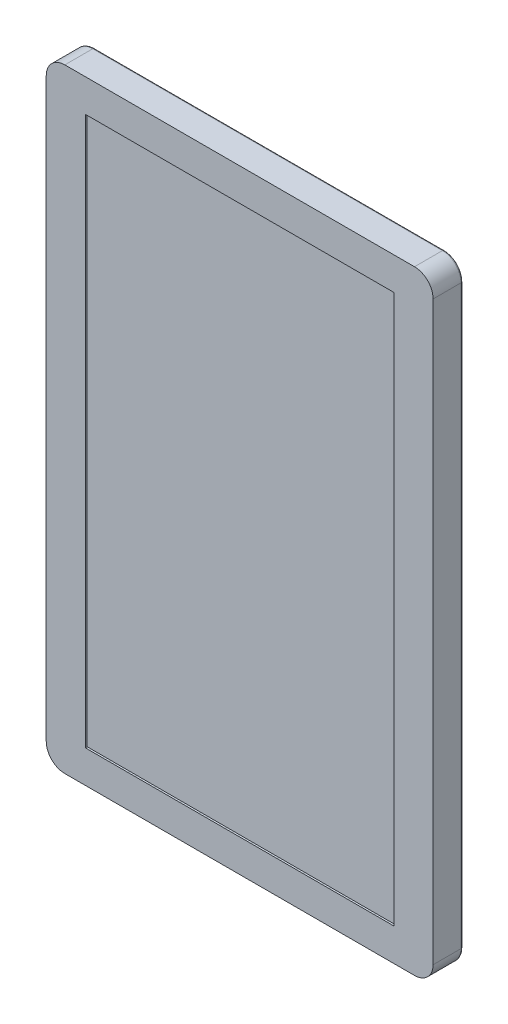
ISO-10303-21;
HEADER;
FILE_DESCRIPTION(('STEP AP214'),'2;1');
FILE_NAME('part.step','',(''),(''),'','','');
FILE_SCHEMA(('AUTOMOTIVE_DESIGN { 1 0 10303 214 1 1 1 1 }'));
ENDSEC;
DATA;
#1=APPLICATION_CONTEXT('core data for automotive mechanical design processes');
#2=APPLICATION_PROTOCOL_DEFINITION('international standard','automotive_design',2000,#1);
#3=PRODUCT_CONTEXT('',#1,'mechanical');
#4=PRODUCT('Part','Part','',(#3));
#5=PRODUCT_RELATED_PRODUCT_CATEGORY('part','',(#4));
#6=PRODUCT_DEFINITION_FORMATION('','',#4);
#7=PRODUCT_DEFINITION_CONTEXT('part definition',#1,'design');
#8=PRODUCT_DEFINITION('design','',#6,#7);
#9=PRODUCT_DEFINITION_SHAPE('','',#8);
#10=(LENGTH_UNIT() NAMED_UNIT(*) SI_UNIT(.MILLI.,.METRE.));
#11=(NAMED_UNIT(*) PLANE_ANGLE_UNIT() SI_UNIT($,.RADIAN.));
#12=(NAMED_UNIT(*) SI_UNIT($,.STERADIAN.) SOLID_ANGLE_UNIT());
#13=UNCERTAINTY_MEASURE_WITH_UNIT(LENGTH_MEASURE(1.E-05),#10,'distance_accuracy_value','');
#14=(GEOMETRIC_REPRESENTATION_CONTEXT(3) GLOBAL_UNCERTAINTY_ASSIGNED_CONTEXT((#13)) GLOBAL_UNIT_ASSIGNED_CONTEXT((#10,
#11,#12)) REPRESENTATION_CONTEXT('',''));
#15=CARTESIAN_POINT('',(0.,0.,0.));
#16=DIRECTION('',(0.,0.,1.));
#17=DIRECTION('',(1.,0.,0.));
#18=AXIS2_PLACEMENT_3D('',#15,#16,#17);
#19=CARTESIAN_POINT('',(-94.,-155.,1.));
#20=DIRECTION('',(0.,0.,1.));
#21=DIRECTION('',(1.,0.,0.));
#22=AXIS2_PLACEMENT_3D('',#19,#20,#21);
#23=TOROIDAL_SURFACE('',#22,9.,1.);
#24=CARTESIAN_POINT('',(-103.,-155.,1.));
#25=DIRECTION('',(0.,1.,0.));
#26=DIRECTION('',(0.,0.,1.));
#27=AXIS2_PLACEMENT_3D('',#24,#25,#26);
#28=CIRCLE('',#27,1.);
#29=CARTESIAN_POINT('',(-103.,-155.,0.));
#30=VERTEX_POINT('',#29);
#31=CARTESIAN_POINT('',(-104.,-155.,1.));
#32=VERTEX_POINT('',#31);
#33=EDGE_CURVE('E11',#30,#32,#28,.T.);
#34=ORIENTED_EDGE('',*,*,#33,.F.);
#35=CARTESIAN_POINT('',(-94.,-155.,0.));
#36=DIRECTION('',(0.,0.,1.));
#37=DIRECTION('',(1.,0.,0.));
#38=AXIS2_PLACEMENT_3D('',#35,#36,#37);
#39=CIRCLE('',#38,9.);
#40=CARTESIAN_POINT('',(-93.9999999999999,-164.,0.));
#41=VERTEX_POINT('',#40);
#42=EDGE_CURVE('E228',#41,#30,#39,.F.);
#43=ORIENTED_EDGE('',*,*,#42,.F.);
#44=CARTESIAN_POINT('',(-93.9999999999999,-164.,1.));
#45=DIRECTION('',(-1.,0.,0.));
#46=DIRECTION('',(0.,0.,1.));
#47=AXIS2_PLACEMENT_3D('',#44,#45,#46);
#48=CIRCLE('',#47,1.);
#49=CARTESIAN_POINT('',(-93.9999999999999,-165.,1.));
#50=VERTEX_POINT('',#49);
#51=EDGE_CURVE('E41',#41,#50,#48,.T.);
#52=ORIENTED_EDGE('',*,*,#51,.T.);
#53=CARTESIAN_POINT('',(-94.,-155.,1.));
#54=DIRECTION('',(0.,0.,1.));
#55=DIRECTION('',(1.,0.,0.));
#56=AXIS2_PLACEMENT_3D('',#53,#54,#55);
#57=CIRCLE('',#56,10.);
#58=EDGE_CURVE('E273',#32,#50,#57,.T.);
#59=ORIENTED_EDGE('',*,*,#58,.F.);
#60=EDGE_LOOP('',(#34,#43,#52,#59));
#61=FACE_BOUND('',#60,.T.);
#62=ADVANCED_FACE('F34',(#61),#23,.T.);
#63=CARTESIAN_POINT('',(94.,-164.,1.));
#64=DIRECTION('',(-1.,0.,0.));
#65=DIRECTION('',(0.,0.,1.));
#66=AXIS2_PLACEMENT_3D('',#63,#64,#65);
#67=CYLINDRICAL_SURFACE('',#66,1.);
#68=ORIENTED_EDGE('',*,*,#51,.F.);
#69=DIRECTION('',(-1.,0.,0.));
#70=VECTOR('',#69,1.);
#71=CARTESIAN_POINT('',(94.,-164.,0.));
#72=LINE('',#71,#70);
#73=CARTESIAN_POINT('',(93.9999999999999,-164.,0.));
#74=VERTEX_POINT('',#73);
#75=EDGE_CURVE('E231',#74,#41,#72,.T.);
#76=ORIENTED_EDGE('',*,*,#75,.F.);
#77=CARTESIAN_POINT('',(93.9999999999999,-164.,1.));
#78=DIRECTION('',(-1.,0.,0.));
#79=DIRECTION('',(0.,0.,1.));
#80=AXIS2_PLACEMENT_3D('',#77,#78,#79);
#81=CIRCLE('',#80,1.);
#82=CARTESIAN_POINT('',(93.9999999999999,-165.,1.));
#83=VERTEX_POINT('',#82);
#84=EDGE_CURVE('E285',#74,#83,#81,.T.);
#85=ORIENTED_EDGE('',*,*,#84,.T.);
#86=DIRECTION('',(-1.,0.,0.));
#87=VECTOR('',#86,1.);
#88=CARTESIAN_POINT('',(-93.9999999999999,-165.,1.));
#89=LINE('',#88,#87);
#90=EDGE_CURVE('E270',#50,#83,#89,.F.);
#91=ORIENTED_EDGE('',*,*,#90,.F.);
#92=EDGE_LOOP('',(#68,#76,#85,#91));
#93=FACE_BOUND('',#92,.T.);
#94=ADVANCED_FACE('F289',(#93),#67,.T.);
#95=CARTESIAN_POINT('',(94.,-155.,1.));
#96=DIRECTION('',(0.,0.,1.));
#97=DIRECTION('',(1.,0.,0.));
#98=AXIS2_PLACEMENT_3D('',#95,#96,#97);
#99=TOROIDAL_SURFACE('',#98,9.,1.);
#100=ORIENTED_EDGE('',*,*,#84,.F.);
#101=CARTESIAN_POINT('',(94.,-155.,0.));
#102=DIRECTION('',(0.,0.,1.));
#103=DIRECTION('',(1.,0.,0.));
#104=AXIS2_PLACEMENT_3D('',#101,#102,#103);
#105=CIRCLE('',#104,9.);
#106=CARTESIAN_POINT('',(103.,-155.,0.));
#107=VERTEX_POINT('',#106);
#108=EDGE_CURVE('E234',#107,#74,#105,.F.);
#109=ORIENTED_EDGE('',*,*,#108,.F.);
#110=CARTESIAN_POINT('',(103.,-155.,1.));
#111=DIRECTION('',(0.,-1.,0.));
#112=DIRECTION('',(0.,0.,-1.));
#113=AXIS2_PLACEMENT_3D('',#110,#111,#112);
#114=CIRCLE('',#113,1.);
#115=CARTESIAN_POINT('',(104.,-155.,1.));
#116=VERTEX_POINT('',#115);
#117=EDGE_CURVE('E283',#107,#116,#114,.T.);
#118=ORIENTED_EDGE('',*,*,#117,.T.);
#119=CARTESIAN_POINT('',(94.,-155.,1.));
#120=DIRECTION('',(0.,0.,1.));
#121=DIRECTION('',(1.,0.,0.));
#122=AXIS2_PLACEMENT_3D('',#119,#120,#121);
#123=CIRCLE('',#122,10.);
#124=EDGE_CURVE('E267',#83,#116,#123,.T.);
#125=ORIENTED_EDGE('',*,*,#124,.F.);
#126=EDGE_LOOP('',(#100,#109,#118,#125));
#127=FACE_BOUND('',#126,.T.);
#128=ADVANCED_FACE('F299',(#127),#99,.T.);
#129=CARTESIAN_POINT('',(103.,-155.,1.));
#130=DIRECTION('',(0.,-1.,0.));
#131=DIRECTION('',(1.,0.,0.));
#132=AXIS2_PLACEMENT_3D('',#129,#130,#131);
#133=CYLINDRICAL_SURFACE('',#132,1.);
#134=ORIENTED_EDGE('',*,*,#117,.F.);
#135=DIRECTION('',(0.,-1.,0.));
#136=VECTOR('',#135,1.);
#137=CARTESIAN_POINT('',(103.,-155.,0.));
#138=LINE('',#137,#136);
#139=CARTESIAN_POINT('',(103.,155.,0.));
#140=VERTEX_POINT('',#139);
#141=EDGE_CURVE('E237',#140,#107,#138,.T.);
#142=ORIENTED_EDGE('',*,*,#141,.F.);
#143=CARTESIAN_POINT('',(103.,155.,1.));
#144=DIRECTION('',(0.,-1.,0.));
#145=DIRECTION('',(0.,0.,-1.));
#146=AXIS2_PLACEMENT_3D('',#143,#144,#145);
#147=CIRCLE('',#146,1.);
#148=CARTESIAN_POINT('',(104.,155.,1.));
#149=VERTEX_POINT('',#148);
#150=EDGE_CURVE('E281',#140,#149,#147,.T.);
#151=ORIENTED_EDGE('',*,*,#150,.T.);
#152=DIRECTION('',(0.,-1.,0.));
#153=VECTOR('',#152,1.);
#154=CARTESIAN_POINT('',(104.,155.,1.));
#155=LINE('',#154,#153);
#156=EDGE_CURVE('E264',#116,#149,#155,.F.);
#157=ORIENTED_EDGE('',*,*,#156,.F.);
#158=EDGE_LOOP('',(#134,#142,#151,#157));
#159=FACE_BOUND('',#158,.T.);
#160=ADVANCED_FACE('F325',(#159),#133,.T.);
#161=CARTESIAN_POINT('',(94.,155.,1.));
#162=DIRECTION('',(0.,0.,1.));
#163=DIRECTION('',(1.,0.,0.));
#164=AXIS2_PLACEMENT_3D('',#161,#162,#163);
#165=TOROIDAL_SURFACE('',#164,9.,1.);
#166=ORIENTED_EDGE('',*,*,#150,.F.);
#167=CARTESIAN_POINT('',(94.,155.,0.));
#168=DIRECTION('',(0.,0.,1.));
#169=DIRECTION('',(1.,0.,0.));
#170=AXIS2_PLACEMENT_3D('',#167,#168,#169);
#171=CIRCLE('',#170,9.);
#172=CARTESIAN_POINT('',(93.9999999999999,164.,0.));
#173=VERTEX_POINT('',#172);
#174=EDGE_CURVE('E240',#173,#140,#171,.F.);
#175=ORIENTED_EDGE('',*,*,#174,.F.);
#176=CARTESIAN_POINT('',(93.9999999999999,164.,1.));
#177=DIRECTION('',(1.,0.,0.));
#178=DIRECTION('',(0.,0.,-1.));
#179=AXIS2_PLACEMENT_3D('',#176,#177,#178);
#180=CIRCLE('',#179,1.);
#181=CARTESIAN_POINT('',(93.9999999999999,165.,1.));
#182=VERTEX_POINT('',#181);
#183=EDGE_CURVE('E279',#173,#182,#180,.T.);
#184=ORIENTED_EDGE('',*,*,#183,.T.);
#185=CARTESIAN_POINT('',(94.,155.,1.));
#186=DIRECTION('',(0.,0.,1.));
#187=DIRECTION('',(1.,0.,0.));
#188=AXIS2_PLACEMENT_3D('',#185,#186,#187);
#189=CIRCLE('',#188,10.);
#190=EDGE_CURVE('E261',#149,#182,#189,.T.);
#191=ORIENTED_EDGE('',*,*,#190,.F.);
#192=EDGE_LOOP('',(#166,#175,#184,#191));
#193=FACE_BOUND('',#192,.T.);
#194=ADVANCED_FACE('F348',(#193),#165,.T.);
#195=CARTESIAN_POINT('',(94.,164.,1.));
#196=DIRECTION('',(1.,0.,0.));
#197=DIRECTION('',(0.,0.,-1.));
#198=AXIS2_PLACEMENT_3D('',#195,#196,#197);
#199=CYLINDRICAL_SURFACE('',#198,1.);
#200=ORIENTED_EDGE('',*,*,#183,.F.);
#201=DIRECTION('',(1.,0.,0.));
#202=VECTOR('',#201,1.);
#203=CARTESIAN_POINT('',(94.,164.,0.));
#204=LINE('',#203,#202);
#205=CARTESIAN_POINT('',(-94.,164.,0.));
#206=VERTEX_POINT('',#205);
#207=EDGE_CURVE('E243',#206,#173,#204,.T.);
#208=ORIENTED_EDGE('',*,*,#207,.F.);
#209=CARTESIAN_POINT('',(-94.,164.,1.));
#210=DIRECTION('',(1.,0.,0.));
#211=DIRECTION('',(0.,0.,-1.));
#212=AXIS2_PLACEMENT_3D('',#209,#210,#211);
#213=CIRCLE('',#212,1.);
#214=CARTESIAN_POINT('',(-94.,165.,1.));
#215=VERTEX_POINT('',#214);
#216=EDGE_CURVE('E277',#206,#215,#213,.T.);
#217=ORIENTED_EDGE('',*,*,#216,.T.);
#218=DIRECTION('',(1.,0.,0.));
#219=VECTOR('',#218,1.);
#220=CARTESIAN_POINT('',(-94.,165.,1.));
#221=LINE('',#220,#219);
#222=EDGE_CURVE('E258',#182,#215,#221,.F.);
#223=ORIENTED_EDGE('',*,*,#222,.F.);
#224=EDGE_LOOP('',(#200,#208,#217,#223));
#225=FACE_BOUND('',#224,.T.);
#226=ADVANCED_FACE('F346',(#225),#199,.T.);
#227=CARTESIAN_POINT('',(-94.,155.,1.));
#228=DIRECTION('',(0.,0.,1.));
#229=DIRECTION('',(1.,0.,0.));
#230=AXIS2_PLACEMENT_3D('',#227,#228,#229);
#231=TOROIDAL_SURFACE('',#230,9.,1.);
#232=ORIENTED_EDGE('',*,*,#216,.F.);
#233=CARTESIAN_POINT('',(-94.,155.,0.));
#234=DIRECTION('',(0.,0.,1.));
#235=DIRECTION('',(1.,0.,0.));
#236=AXIS2_PLACEMENT_3D('',#233,#234,#235);
#237=CIRCLE('',#236,9.);
#238=CARTESIAN_POINT('',(-103.,155.,0.));
#239=VERTEX_POINT('',#238);
#240=EDGE_CURVE('E246',#239,#206,#237,.F.);
#241=ORIENTED_EDGE('',*,*,#240,.F.);
#242=CARTESIAN_POINT('',(-103.,155.,1.));
#243=DIRECTION('',(0.,1.,0.));
#244=DIRECTION('',(0.,0.,1.));
#245=AXIS2_PLACEMENT_3D('',#242,#243,#244);
#246=CIRCLE('',#245,1.);
#247=CARTESIAN_POINT('',(-104.,155.,1.));
#248=VERTEX_POINT('',#247);
#249=EDGE_CURVE('E275',#239,#248,#246,.T.);
#250=ORIENTED_EDGE('',*,*,#249,.T.);
#251=CARTESIAN_POINT('',(-94.,155.,1.));
#252=DIRECTION('',(0.,0.,1.));
#253=DIRECTION('',(1.,0.,0.));
#254=AXIS2_PLACEMENT_3D('',#251,#252,#253);
#255=CIRCLE('',#254,10.);
#256=EDGE_CURVE('E255',#215,#248,#255,.T.);
#257=ORIENTED_EDGE('',*,*,#256,.F.);
#258=EDGE_LOOP('',(#232,#241,#250,#257));
#259=FACE_BOUND('',#258,.T.);
#260=ADVANCED_FACE('F343',(#259),#231,.T.);
#261=CARTESIAN_POINT('',(-103.,-155.,1.));
#262=DIRECTION('',(0.,1.,0.));
#263=DIRECTION('',(-1.,0.,0.));
#264=AXIS2_PLACEMENT_3D('',#261,#262,#263);
#265=CYLINDRICAL_SURFACE('',#264,1.);
#266=DIRECTION('',(0.,1.,0.));
#267=VECTOR('',#266,1.);
#268=CARTESIAN_POINT('',(-103.,-155.,0.));
#269=LINE('',#268,#267);
#270=EDGE_CURVE('E249',#30,#239,#269,.T.);
#271=ORIENTED_EDGE('',*,*,#270,.F.);
#272=ORIENTED_EDGE('',*,*,#33,.T.);
#273=DIRECTION('',(0.,1.,0.));
#274=VECTOR('',#273,1.);
#275=CARTESIAN_POINT('',(-104.,155.,1.));
#276=LINE('',#275,#274);
#277=EDGE_CURVE('E252',#248,#32,#276,.F.);
#278=ORIENTED_EDGE('',*,*,#277,.F.);
#279=ORIENTED_EDGE('',*,*,#249,.F.);
#280=EDGE_LOOP('',(#271,#272,#278,#279));
#281=FACE_BOUND('',#280,.T.);
#282=ADVANCED_FACE('F318',(#281),#265,.T.);
#283=CARTESIAN_POINT('',(94.,-155.,16.));
#284=DIRECTION('',(0.,0.,-1.));
#285=DIRECTION('',(-1.,0.,0.));
#286=AXIS2_PLACEMENT_3D('',#283,#284,#285);
#287=CYLINDRICAL_SURFACE('',#286,10.);
#288=DIRECTION('',(0.,0.,-1.));
#289=VECTOR('',#288,1.);
#290=CARTESIAN_POINT('',(93.9999999999999,-165.,16.));
#291=LINE('',#290,#289);
#292=CARTESIAN_POINT('',(93.9999999999999,-165.,16.));
#293=VERTEX_POINT('',#292);
#294=EDGE_CURVE('E204',#293,#83,#291,.T.);
#295=ORIENTED_EDGE('',*,*,#294,.T.);
#296=ORIENTED_EDGE('',*,*,#124,.T.);
#297=DIRECTION('',(0.,0.,-1.));
#298=VECTOR('',#297,1.);
#299=CARTESIAN_POINT('',(104.,-155.,16.));
#300=LINE('',#299,#298);
#301=CARTESIAN_POINT('',(104.,-155.,16.));
#302=VERTEX_POINT('',#301);
#303=EDGE_CURVE('E225',#302,#116,#300,.T.);
#304=ORIENTED_EDGE('',*,*,#303,.F.);
#305=CARTESIAN_POINT('',(94.,-155.,16.));
#306=DIRECTION('',(0.,0.,1.));
#307=DIRECTION('',(1.,0.,0.));
#308=AXIS2_PLACEMENT_3D('',#305,#306,#307);
#309=CIRCLE('',#308,10.);
#310=EDGE_CURVE('E184',#293,#302,#309,.T.);
#311=ORIENTED_EDGE('',*,*,#310,.F.);
#312=EDGE_LOOP('',(#295,#296,#304,#311));
#313=FACE_BOUND('',#312,.T.);
#314=ADVANCED_FACE('F303',(#313),#287,.T.);
#315=CARTESIAN_POINT('',(104.,155.,16.));
#316=DIRECTION('',(-1.,0.,0.));
#317=DIRECTION('',(0.,-1.,0.));
#318=AXIS2_PLACEMENT_3D('',#315,#316,#317);
#319=PLANE('',#318);
#320=ORIENTED_EDGE('',*,*,#303,.T.);
#321=ORIENTED_EDGE('',*,*,#156,.T.);
#322=DIRECTION('',(0.,0.,-1.));
#323=VECTOR('',#322,1.);
#324=CARTESIAN_POINT('',(104.,155.,16.));
#325=LINE('',#324,#323);
#326=CARTESIAN_POINT('',(104.,155.,16.));
#327=VERTEX_POINT('',#326);
#328=EDGE_CURVE('E222',#327,#149,#325,.T.);
#329=ORIENTED_EDGE('',*,*,#328,.F.);
#330=DIRECTION('',(0.,1.,0.));
#331=VECTOR('',#330,1.);
#332=CARTESIAN_POINT('',(104.,155.,16.));
#333=LINE('',#332,#331);
#334=EDGE_CURVE('E190',#302,#327,#333,.T.);
#335=ORIENTED_EDGE('',*,*,#334,.F.);
#336=EDGE_LOOP('',(#320,#321,#329,#335));
#337=FACE_BOUND('',#336,.T.);
#338=ADVANCED_FACE('F328',(#337),#319,.F.);
#339=CARTESIAN_POINT('',(94.,155.,16.));
#340=DIRECTION('',(0.,0.,-1.));
#341=DIRECTION('',(-1.,0.,0.));
#342=AXIS2_PLACEMENT_3D('',#339,#340,#341);
#343=CYLINDRICAL_SURFACE('',#342,10.);
#344=ORIENTED_EDGE('',*,*,#328,.T.);
#345=ORIENTED_EDGE('',*,*,#190,.T.);
#346=DIRECTION('',(0.,0.,-1.));
#347=VECTOR('',#346,1.);
#348=CARTESIAN_POINT('',(93.9999999999999,165.,16.));
#349=LINE('',#348,#347);
#350=CARTESIAN_POINT('',(93.9999999999999,165.,16.));
#351=VERTEX_POINT('',#350);
#352=EDGE_CURVE('E219',#351,#182,#349,.T.);
#353=ORIENTED_EDGE('',*,*,#352,.F.);
#354=CARTESIAN_POINT('',(94.,155.,16.));
#355=DIRECTION('',(0.,0.,1.));
#356=DIRECTION('',(-1.,0.,0.));
#357=AXIS2_PLACEMENT_3D('',#354,#355,#356);
#358=CIRCLE('',#357,10.);
#359=EDGE_CURVE('E192',#327,#351,#358,.T.);
#360=ORIENTED_EDGE('',*,*,#359,.F.);
#361=EDGE_LOOP('',(#344,#345,#353,#360));
#362=FACE_BOUND('',#361,.T.);
#363=ADVANCED_FACE('F332',(#362),#343,.T.);
#364=CARTESIAN_POINT('',(-94.,165.,16.));
#365=DIRECTION('',(0.,-1.,0.));
#366=DIRECTION('',(0.,0.,-1.));
#367=AXIS2_PLACEMENT_3D('',#364,#365,#366);
#368=PLANE('',#367);
#369=ORIENTED_EDGE('',*,*,#352,.T.);
#370=ORIENTED_EDGE('',*,*,#222,.T.);
#371=DIRECTION('',(0.,0.,-1.));
#372=VECTOR('',#371,1.);
#373=CARTESIAN_POINT('',(-94.,165.,16.));
#374=LINE('',#373,#372);
#375=CARTESIAN_POINT('',(-94.,165.,16.));
#376=VERTEX_POINT('',#375);
#377=EDGE_CURVE('E216',#376,#215,#374,.T.);
#378=ORIENTED_EDGE('',*,*,#377,.F.);
#379=DIRECTION('',(-1.,0.,0.));
#380=VECTOR('',#379,1.);
#381=CARTESIAN_POINT('',(-94.,165.,16.));
#382=LINE('',#381,#380);
#383=EDGE_CURVE('E194',#351,#376,#382,.T.);
#384=ORIENTED_EDGE('',*,*,#383,.F.);
#385=EDGE_LOOP('',(#369,#370,#378,#384));
#386=FACE_BOUND('',#385,.T.);
#387=ADVANCED_FACE('F337',(#386),#368,.F.);
#388=CARTESIAN_POINT('',(-94.,155.,16.));
#389=DIRECTION('',(0.,0.,-1.));
#390=DIRECTION('',(-1.,0.,0.));
#391=AXIS2_PLACEMENT_3D('',#388,#389,#390);
#392=CYLINDRICAL_SURFACE('',#391,10.);
#393=ORIENTED_EDGE('',*,*,#377,.T.);
#394=ORIENTED_EDGE('',*,*,#256,.T.);
#395=DIRECTION('',(0.,0.,-1.));
#396=VECTOR('',#395,1.);
#397=CARTESIAN_POINT('',(-104.,155.,16.));
#398=LINE('',#397,#396);
#399=CARTESIAN_POINT('',(-104.,155.,16.));
#400=VERTEX_POINT('',#399);
#401=EDGE_CURVE('E213',#400,#248,#398,.T.);
#402=ORIENTED_EDGE('',*,*,#401,.F.);
#403=CARTESIAN_POINT('',(-94.,155.,16.));
#404=DIRECTION('',(0.,0.,1.));
#405=DIRECTION('',(1.,0.,0.));
#406=AXIS2_PLACEMENT_3D('',#403,#404,#405);
#407=CIRCLE('',#406,10.);
#408=EDGE_CURVE('E196',#376,#400,#407,.T.);
#409=ORIENTED_EDGE('',*,*,#408,.F.);
#410=EDGE_LOOP('',(#393,#394,#402,#409));
#411=FACE_BOUND('',#410,.T.);
#412=ADVANCED_FACE('F341',(#411),#392,.T.);
#413=CARTESIAN_POINT('',(-104.,155.,16.));
#414=DIRECTION('',(1.,0.,0.));
#415=DIRECTION('',(0.,1.,0.));
#416=AXIS2_PLACEMENT_3D('',#413,#414,#415);
#417=PLANE('',#416);
#418=ORIENTED_EDGE('',*,*,#401,.T.);
#419=ORIENTED_EDGE('',*,*,#277,.T.);
#420=DIRECTION('',(0.,0.,-1.));
#421=VECTOR('',#420,1.);
#422=CARTESIAN_POINT('',(-104.,-155.,16.));
#423=LINE('',#422,#421);
#424=CARTESIAN_POINT('',(-104.,-155.,16.));
#425=VERTEX_POINT('',#424);
#426=EDGE_CURVE('E210',#425,#32,#423,.T.);
#427=ORIENTED_EDGE('',*,*,#426,.F.);
#428=DIRECTION('',(0.,-1.,0.));
#429=VECTOR('',#428,1.);
#430=CARTESIAN_POINT('',(-104.,155.,16.));
#431=LINE('',#430,#429);
#432=EDGE_CURVE('E198',#400,#425,#431,.T.);
#433=ORIENTED_EDGE('',*,*,#432,.F.);
#434=EDGE_LOOP('',(#418,#419,#427,#433));
#435=FACE_BOUND('',#434,.T.);
#436=ADVANCED_FACE('F315',(#435),#417,.F.);
#437=CARTESIAN_POINT('',(-94.,-155.,16.));
#438=DIRECTION('',(0.,0.,-1.));
#439=DIRECTION('',(-1.,0.,0.));
#440=AXIS2_PLACEMENT_3D('',#437,#438,#439);
#441=CYLINDRICAL_SURFACE('',#440,10.);
#442=ORIENTED_EDGE('',*,*,#426,.T.);
#443=ORIENTED_EDGE('',*,*,#58,.T.);
#444=DIRECTION('',(0.,0.,-1.));
#445=VECTOR('',#444,1.);
#446=CARTESIAN_POINT('',(-93.9999999999999,-165.,16.));
#447=LINE('',#446,#445);
#448=CARTESIAN_POINT('',(-93.9999999999999,-165.,16.));
#449=VERTEX_POINT('',#448);
#450=EDGE_CURVE('E207',#449,#50,#447,.T.);
#451=ORIENTED_EDGE('',*,*,#450,.F.);
#452=CARTESIAN_POINT('',(-94.,-155.,16.));
#453=DIRECTION('',(0.,0.,1.));
#454=DIRECTION('',(1.,0.,0.));
#455=AXIS2_PLACEMENT_3D('',#452,#453,#454);
#456=CIRCLE('',#455,10.);
#457=EDGE_CURVE('E200',#425,#449,#456,.T.);
#458=ORIENTED_EDGE('',*,*,#457,.F.);
#459=EDGE_LOOP('',(#442,#443,#451,#458));
#460=FACE_BOUND('',#459,.T.);
#461=ADVANCED_FACE('F311',(#460),#441,.T.);
#462=CARTESIAN_POINT('',(-93.9999999999999,-165.,16.));
#463=DIRECTION('',(0.,1.,0.));
#464=DIRECTION('',(0.,0.,1.));
#465=AXIS2_PLACEMENT_3D('',#462,#463,#464);
#466=PLANE('',#465);
#467=ORIENTED_EDGE('',*,*,#450,.T.);
#468=ORIENTED_EDGE('',*,*,#90,.T.);
#469=ORIENTED_EDGE('',*,*,#294,.F.);
#470=DIRECTION('',(1.,0.,0.));
#471=VECTOR('',#470,1.);
#472=CARTESIAN_POINT('',(-93.9999999999999,-165.,16.));
#473=LINE('',#472,#471);
#474=EDGE_CURVE('E202',#449,#293,#473,.T.);
#475=ORIENTED_EDGE('',*,*,#474,.F.);
#476=EDGE_LOOP('',(#467,#468,#469,#475));
#477=FACE_BOUND('',#476,.T.);
#478=ADVANCED_FACE('F295',(#477),#466,.F.);
#479=CARTESIAN_POINT('',(94.,-155.,16.));
#480=DIRECTION('',(0.,0.,1.));
#481=DIRECTION('',(1.,0.,0.));
#482=AXIS2_PLACEMENT_3D('',#479,#480,#481);
#483=PLANE('',#482);
#484=DIRECTION('',(0.,1.,0.));
#485=VECTOR('',#484,1.);
#486=CARTESIAN_POINT('',(83.,147.5,16.));
#487=LINE('',#486,#485);
#488=CARTESIAN_POINT('',(83.,-147.5,16.));
#489=VERTEX_POINT('',#488);
#490=CARTESIAN_POINT('',(83.,147.5,16.));
#491=VERTEX_POINT('',#490);
#492=EDGE_CURVE('E48',#489,#491,#487,.T.);
#493=ORIENTED_EDGE('',*,*,#492,.F.);
#494=DIRECTION('',(1.,0.,0.));
#495=VECTOR('',#494,1.);
#496=CARTESIAN_POINT('',(-83.,-147.5,16.));
#497=LINE('',#496,#495);
#498=CARTESIAN_POINT('',(-83.,-147.5,16.));
#499=VERTEX_POINT('',#498);
#500=EDGE_CURVE('E165',#499,#489,#497,.T.);
#501=ORIENTED_EDGE('',*,*,#500,.F.);
#502=DIRECTION('',(0.,-1.,0.));
#503=VECTOR('',#502,1.);
#504=CARTESIAN_POINT('',(-83.,147.5,16.));
#505=LINE('',#504,#503);
#506=CARTESIAN_POINT('',(-83.,147.5,16.));
#507=VERTEX_POINT('',#506);
#508=EDGE_CURVE('E168',#507,#499,#505,.T.);
#509=ORIENTED_EDGE('',*,*,#508,.F.);
#510=DIRECTION('',(-1.,0.,0.));
#511=VECTOR('',#510,1.);
#512=CARTESIAN_POINT('',(-83.,147.5,16.));
#513=LINE('',#512,#511);
#514=EDGE_CURVE('E177',#491,#507,#513,.T.);
#515=ORIENTED_EDGE('',*,*,#514,.F.);
#516=EDGE_LOOP('',(#493,#501,#509,#515));
#517=FACE_BOUND('',#516,.T.);
#518=ORIENTED_EDGE('',*,*,#310,.T.);
#519=ORIENTED_EDGE('',*,*,#334,.T.);
#520=ORIENTED_EDGE('',*,*,#359,.T.);
#521=ORIENTED_EDGE('',*,*,#383,.T.);
#522=ORIENTED_EDGE('',*,*,#408,.T.);
#523=ORIENTED_EDGE('',*,*,#432,.T.);
#524=ORIENTED_EDGE('',*,*,#457,.T.);
#525=ORIENTED_EDGE('',*,*,#474,.T.);
#526=EDGE_LOOP('',(#518,#519,#520,#521,#522,#523,#524,#525));
#527=FACE_BOUND('',#526,.T.);
#528=ADVANCED_FACE('F305',(#517,#527),#483,.T.);
#529=CARTESIAN_POINT('',(94.,-155.,0.));
#530=DIRECTION('',(0.,0.,1.));
#531=DIRECTION('',(1.,0.,0.));
#532=AXIS2_PLACEMENT_3D('',#529,#530,#531);
#533=PLANE('',#532);
#534=CARTESIAN_POINT('',(50.,-50.,0.));
#535=DIRECTION('',(0.,0.,-1.));
#536=DIRECTION('',(-1.,0.,0.));
#537=AXIS2_PLACEMENT_3D('',#534,#535,#536);
#538=CIRCLE('',#537,2.5);
#539=CARTESIAN_POINT('',(47.5,-50.,0.));
#540=VERTEX_POINT('',#539);
#541=EDGE_CURVE('E612',#540,#540,#538,.T.);
#542=ORIENTED_EDGE('',*,*,#541,.F.);
#543=EDGE_LOOP('',(#542));
#544=FACE_BOUND('',#543,.T.);
#545=CARTESIAN_POINT('',(-50.,-50.,0.));
#546=DIRECTION('',(0.,0.,-1.));
#547=DIRECTION('',(-1.,0.,0.));
#548=AXIS2_PLACEMENT_3D('',#545,#546,#547);
#549=CIRCLE('',#548,2.5);
#550=CARTESIAN_POINT('',(-52.5,-50.,0.));
#551=VERTEX_POINT('',#550);
#552=EDGE_CURVE('E611',#551,#551,#549,.T.);
#553=ORIENTED_EDGE('',*,*,#552,.F.);
#554=EDGE_LOOP('',(#553));
#555=FACE_BOUND('',#554,.T.);
#556=CARTESIAN_POINT('',(-50.,50.,0.));
#557=DIRECTION('',(0.,0.,-1.));
#558=DIRECTION('',(-1.,0.,0.));
#559=AXIS2_PLACEMENT_3D('',#556,#557,#558);
#560=CIRCLE('',#559,2.5);
#561=CARTESIAN_POINT('',(-52.5,50.,0.));
#562=VERTEX_POINT('',#561);
#563=EDGE_CURVE('E627',#562,#562,#560,.T.);
#564=ORIENTED_EDGE('',*,*,#563,.F.);
#565=EDGE_LOOP('',(#564));
#566=FACE_BOUND('',#565,.T.);
#567=CARTESIAN_POINT('',(50.,50.,0.));
#568=DIRECTION('',(0.,0.,-1.));
#569=DIRECTION('',(-1.,0.,0.));
#570=AXIS2_PLACEMENT_3D('',#567,#568,#569);
#571=CIRCLE('',#570,2.5);
#572=CARTESIAN_POINT('',(47.5,50.,0.));
#573=VERTEX_POINT('',#572);
#574=EDGE_CURVE('E171',#573,#573,#571,.T.);
#575=ORIENTED_EDGE('',*,*,#574,.F.);
#576=EDGE_LOOP('',(#575));
#577=FACE_BOUND('',#576,.T.);
#578=ORIENTED_EDGE('',*,*,#42,.T.);
#579=ORIENTED_EDGE('',*,*,#270,.T.);
#580=ORIENTED_EDGE('',*,*,#240,.T.);
#581=ORIENTED_EDGE('',*,*,#207,.T.);
#582=ORIENTED_EDGE('',*,*,#174,.T.);
#583=ORIENTED_EDGE('',*,*,#141,.T.);
#584=ORIENTED_EDGE('',*,*,#108,.T.);
#585=ORIENTED_EDGE('',*,*,#75,.T.);
#586=EDGE_LOOP('',(#578,#579,#580,#581,#582,#583,#584,#585));
#587=FACE_BOUND('',#586,.T.);
#588=ADVANCED_FACE('F321',(#544,#555,#566,#577,#587),#533,.F.);
#589=CARTESIAN_POINT('',(83.,147.5,15.));
#590=DIRECTION('',(1.,0.,0.));
#591=DIRECTION('',(0.,1.,0.));
#592=AXIS2_PLACEMENT_3D('',#589,#590,#591);
#593=PLANE('',#592);
#594=ORIENTED_EDGE('',*,*,#492,.T.);
#595=DIRECTION('',(0.,0.,1.));
#596=VECTOR('',#595,1.);
#597=CARTESIAN_POINT('',(83.,147.5,15.));
#598=LINE('',#597,#596);
#599=CARTESIAN_POINT('',(83.,147.5,15.));
#600=VERTEX_POINT('',#599);
#601=EDGE_CURVE('E143',#600,#491,#598,.T.);
#602=ORIENTED_EDGE('',*,*,#601,.F.);
#603=DIRECTION('',(0.,1.,0.));
#604=VECTOR('',#603,1.);
#605=CARTESIAN_POINT('',(83.,147.5,15.));
#606=LINE('',#605,#604);
#607=CARTESIAN_POINT('',(83.,-147.5,15.));
#608=VERTEX_POINT('',#607);
#609=EDGE_CURVE('E147',#608,#600,#606,.T.);
#610=ORIENTED_EDGE('',*,*,#609,.F.);
#611=DIRECTION('',(0.,0.,1.));
#612=VECTOR('',#611,1.);
#613=CARTESIAN_POINT('',(83.,-147.5,15.));
#614=LINE('',#613,#612);
#615=EDGE_CURVE('E182',#608,#489,#614,.T.);
#616=ORIENTED_EDGE('',*,*,#615,.T.);
#617=EDGE_LOOP('',(#594,#602,#610,#616));
#618=FACE_BOUND('',#617,.T.);
#619=ADVANCED_FACE('F145',(#618),#593,.F.);
#620=CARTESIAN_POINT('',(-83.,-147.5,15.));
#621=DIRECTION('',(0.,-1.,0.));
#622=DIRECTION('',(0.,0.,-1.));
#623=AXIS2_PLACEMENT_3D('',#620,#621,#622);
#624=PLANE('',#623);
#625=ORIENTED_EDGE('',*,*,#500,.T.);
#626=ORIENTED_EDGE('',*,*,#615,.F.);
#627=DIRECTION('',(1.,0.,0.));
#628=VECTOR('',#627,1.);
#629=CARTESIAN_POINT('',(-83.,-147.5,15.));
#630=LINE('',#629,#628);
#631=CARTESIAN_POINT('',(-83.,-147.5,15.));
#632=VERTEX_POINT('',#631);
#633=EDGE_CURVE('E153',#632,#608,#630,.T.);
#634=ORIENTED_EDGE('',*,*,#633,.F.);
#635=DIRECTION('',(0.,0.,1.));
#636=VECTOR('',#635,1.);
#637=CARTESIAN_POINT('',(-83.,-147.5,15.));
#638=LINE('',#637,#636);
#639=EDGE_CURVE('E185',#632,#499,#638,.T.);
#640=ORIENTED_EDGE('',*,*,#639,.T.);
#641=EDGE_LOOP('',(#625,#626,#634,#640));
#642=FACE_BOUND('',#641,.T.);
#643=ADVANCED_FACE('F481',(#642),#624,.F.);
#644=CARTESIAN_POINT('',(-83.,147.5,15.));
#645=DIRECTION('',(-1.,0.,0.));
#646=DIRECTION('',(0.,-1.,0.));
#647=AXIS2_PLACEMENT_3D('',#644,#645,#646);
#648=PLANE('',#647);
#649=ORIENTED_EDGE('',*,*,#508,.T.);
#650=ORIENTED_EDGE('',*,*,#639,.F.);
#651=DIRECTION('',(0.,-1.,0.));
#652=VECTOR('',#651,1.);
#653=CARTESIAN_POINT('',(-83.,147.5,15.));
#654=LINE('',#653,#652);
#655=CARTESIAN_POINT('',(-83.,147.5,15.));
#656=VERTEX_POINT('',#655);
#657=EDGE_CURVE('E161',#656,#632,#654,.T.);
#658=ORIENTED_EDGE('',*,*,#657,.F.);
#659=DIRECTION('',(0.,0.,1.));
#660=VECTOR('',#659,1.);
#661=CARTESIAN_POINT('',(-83.,147.5,15.));
#662=LINE('',#661,#660);
#663=EDGE_CURVE('E152',#656,#507,#662,.T.);
#664=ORIENTED_EDGE('',*,*,#663,.T.);
#665=EDGE_LOOP('',(#649,#650,#658,#664));
#666=FACE_BOUND('',#665,.T.);
#667=ADVANCED_FACE('F490',(#666),#648,.F.);
#668=CARTESIAN_POINT('',(-83.,147.5,15.));
#669=DIRECTION('',(0.,1.,0.));
#670=DIRECTION('',(0.,0.,1.));
#671=AXIS2_PLACEMENT_3D('',#668,#669,#670);
#672=PLANE('',#671);
#673=ORIENTED_EDGE('',*,*,#514,.T.);
#674=ORIENTED_EDGE('',*,*,#663,.F.);
#675=DIRECTION('',(-1.,0.,0.));
#676=VECTOR('',#675,1.);
#677=CARTESIAN_POINT('',(-83.,147.5,15.));
#678=LINE('',#677,#676);
#679=EDGE_CURVE('E156',#600,#656,#678,.T.);
#680=ORIENTED_EDGE('',*,*,#679,.F.);
#681=ORIENTED_EDGE('',*,*,#601,.T.);
#682=EDGE_LOOP('',(#673,#674,#680,#681));
#683=FACE_BOUND('',#682,.T.);
#684=ADVANCED_FACE('F157',(#683),#672,.F.);
#685=CARTESIAN_POINT('',(0.,0.,15.));
#686=DIRECTION('',(0.,0.,1.));
#687=DIRECTION('',(1.,0.,0.));
#688=AXIS2_PLACEMENT_3D('',#685,#686,#687);
#689=PLANE('',#688);
#690=ORIENTED_EDGE('',*,*,#609,.T.);
#691=ORIENTED_EDGE('',*,*,#679,.T.);
#692=ORIENTED_EDGE('',*,*,#657,.T.);
#693=ORIENTED_EDGE('',*,*,#633,.T.);
#694=EDGE_LOOP('',(#690,#691,#692,#693));
#695=FACE_BOUND('',#694,.T.);
#696=ADVANCED_FACE('F163',(#695),#689,.T.);
#697=CARTESIAN_POINT('',(50.,50.,10.));
#698=DIRECTION('',(0.,0.,-1.));
#699=DIRECTION('',(-1.,0.,0.));
#700=AXIS2_PLACEMENT_3D('',#697,#698,#699);
#701=CYLINDRICAL_SURFACE('',#700,2.5);
#702=CARTESIAN_POINT('',(50.,50.,10.));
#703=DIRECTION('',(0.,0.,-1.));
#704=DIRECTION('',(-1.,0.,0.));
#705=AXIS2_PLACEMENT_3D('',#702,#703,#704);
#706=CIRCLE('',#705,2.5);
#707=CARTESIAN_POINT('',(47.5,50.,10.));
#708=VERTEX_POINT('',#707);
#709=EDGE_CURVE('E178',#708,#708,#706,.T.);
#710=ORIENTED_EDGE('',*,*,#709,.F.);
#711=EDGE_LOOP('',(#710));
#712=FACE_BOUND('',#711,.T.);
#713=ORIENTED_EDGE('',*,*,#574,.T.);
#714=EDGE_LOOP('',(#713));
#715=FACE_BOUND('',#714,.T.);
#716=ADVANCED_FACE('F517',(#712,#715),#701,.F.);
#717=CARTESIAN_POINT('',(50.,50.,10.));
#718=DIRECTION('',(0.,0.,-1.));
#719=DIRECTION('',(-1.,0.,0.));
#720=AXIS2_PLACEMENT_3D('',#717,#718,#719);
#721=PLANE('',#720);
#722=ORIENTED_EDGE('',*,*,#709,.T.);
#723=EDGE_LOOP('',(#722));
#724=FACE_BOUND('',#723,.T.);
#725=ADVANCED_FACE('F534',(#724),#721,.T.);
#726=CARTESIAN_POINT('',(-50.,50.,10.));
#727=DIRECTION('',(0.,0.,-1.));
#728=DIRECTION('',(-1.,0.,0.));
#729=AXIS2_PLACEMENT_3D('',#726,#727,#728);
#730=CYLINDRICAL_SURFACE('',#729,2.5);
#731=CARTESIAN_POINT('',(-50.,50.,10.));
#732=DIRECTION('',(0.,0.,-1.));
#733=DIRECTION('',(-1.,0.,0.));
#734=AXIS2_PLACEMENT_3D('',#731,#732,#733);
#735=CIRCLE('',#734,2.5);
#736=CARTESIAN_POINT('',(-52.5,50.,10.));
#737=VERTEX_POINT('',#736);
#738=EDGE_CURVE('E623',#737,#737,#735,.T.);
#739=ORIENTED_EDGE('',*,*,#738,.F.);
#740=EDGE_LOOP('',(#739));
#741=FACE_BOUND('',#740,.T.);
#742=ORIENTED_EDGE('',*,*,#563,.T.);
#743=EDGE_LOOP('',(#742));
#744=FACE_BOUND('',#743,.T.);
#745=ADVANCED_FACE('F544',(#741,#744),#730,.F.);
#746=CARTESIAN_POINT('',(-50.,50.,10.));
#747=DIRECTION('',(0.,0.,-1.));
#748=DIRECTION('',(-1.,0.,0.));
#749=AXIS2_PLACEMENT_3D('',#746,#747,#748);
#750=PLANE('',#749);
#751=ORIENTED_EDGE('',*,*,#738,.T.);
#752=EDGE_LOOP('',(#751));
#753=FACE_BOUND('',#752,.T.);
#754=ADVANCED_FACE('F554',(#753),#750,.T.);
#755=CARTESIAN_POINT('',(-50.,-50.,10.));
#756=DIRECTION('',(0.,0.,-1.));
#757=DIRECTION('',(-1.,0.,0.));
#758=AXIS2_PLACEMENT_3D('',#755,#756,#757);
#759=CYLINDRICAL_SURFACE('',#758,2.5);
#760=CARTESIAN_POINT('',(-50.,-50.,10.));
#761=DIRECTION('',(0.,0.,-1.));
#762=DIRECTION('',(-1.,0.,0.));
#763=AXIS2_PLACEMENT_3D('',#760,#761,#762);
#764=CIRCLE('',#763,2.5);
#765=CARTESIAN_POINT('',(-52.5,-50.,10.));
#766=VERTEX_POINT('',#765);
#767=EDGE_CURVE('E615',#766,#766,#764,.T.);
#768=ORIENTED_EDGE('',*,*,#767,.F.);
#769=EDGE_LOOP('',(#768));
#770=FACE_BOUND('',#769,.T.);
#771=ORIENTED_EDGE('',*,*,#552,.T.);
#772=EDGE_LOOP('',(#771));
#773=FACE_BOUND('',#772,.T.);
#774=ADVANCED_FACE('F564',(#770,#773),#759,.F.);
#775=CARTESIAN_POINT('',(-50.,-50.,10.));
#776=DIRECTION('',(0.,0.,-1.));
#777=DIRECTION('',(-1.,0.,0.));
#778=AXIS2_PLACEMENT_3D('',#775,#776,#777);
#779=PLANE('',#778);
#780=ORIENTED_EDGE('',*,*,#767,.T.);
#781=EDGE_LOOP('',(#780));
#782=FACE_BOUND('',#781,.T.);
#783=ADVANCED_FACE('F574',(#782),#779,.T.);
#784=CARTESIAN_POINT('',(50.,-50.,10.));
#785=DIRECTION('',(0.,0.,-1.));
#786=DIRECTION('',(-1.,0.,0.));
#787=AXIS2_PLACEMENT_3D('',#784,#785,#786);
#788=CYLINDRICAL_SURFACE('',#787,2.5);
#789=CARTESIAN_POINT('',(50.,-50.,10.));
#790=DIRECTION('',(0.,0.,-1.));
#791=DIRECTION('',(-1.,0.,0.));
#792=AXIS2_PLACEMENT_3D('',#789,#790,#791);
#793=CIRCLE('',#792,2.5);
#794=CARTESIAN_POINT('',(47.5,-50.,10.));
#795=VERTEX_POINT('',#794);
#796=EDGE_CURVE('E610',#795,#795,#793,.T.);
#797=ORIENTED_EDGE('',*,*,#796,.F.);
#798=EDGE_LOOP('',(#797));
#799=FACE_BOUND('',#798,.T.);
#800=ORIENTED_EDGE('',*,*,#541,.T.);
#801=EDGE_LOOP('',(#800));
#802=FACE_BOUND('',#801,.T.);
#803=ADVANCED_FACE('F584',(#799,#802),#788,.F.);
#804=CARTESIAN_POINT('',(50.,-50.,10.));
#805=DIRECTION('',(0.,0.,-1.));
#806=DIRECTION('',(-1.,0.,0.));
#807=AXIS2_PLACEMENT_3D('',#804,#805,#806);
#808=PLANE('',#807);
#809=ORIENTED_EDGE('',*,*,#796,.T.);
#810=EDGE_LOOP('',(#809));
#811=FACE_BOUND('',#810,.T.);
#812=ADVANCED_FACE('F594',(#811),#808,.T.);
#813=CLOSED_SHELL('',(#62,#94,#128,#160,#194,#226,#260,#282,#314,#338,#363,#387,#412,#436,#461,
#478,#528,#588,#619,#643,#667,#684,#696,#716,#725,#745,#754,#774,#783,#803,#812));
#814=MANIFOLD_SOLID_BREP('B2',#813);
#815=ADVANCED_BREP_SHAPE_REPRESENTATION('',(#18,#814),#14);
#816=SHAPE_DEFINITION_REPRESENTATION(#9,#815);
ENDSEC;
END-ISO-10303-21;
